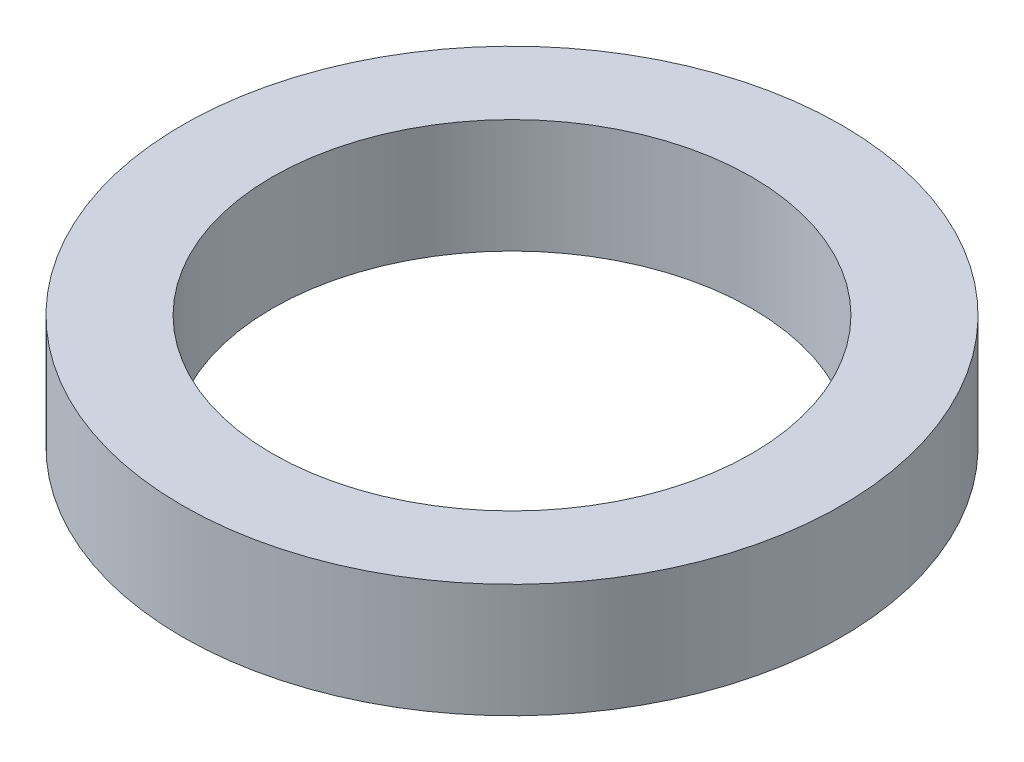
ISO-10303-21;
HEADER;
FILE_DESCRIPTION(('STEP AP214'),'2;1');
FILE_NAME('part.step','',(''),(''),'','','');
FILE_SCHEMA(('AUTOMOTIVE_DESIGN { 1 0 10303 214 1 1 1 1 }'));
ENDSEC;
DATA;
#1=APPLICATION_CONTEXT('core data for automotive mechanical design processes');
#2=APPLICATION_PROTOCOL_DEFINITION('international standard','automotive_design',2000,#1);
#3=PRODUCT_CONTEXT('',#1,'mechanical');
#4=PRODUCT('Part','Part','',(#3));
#5=PRODUCT_RELATED_PRODUCT_CATEGORY('part','',(#4));
#6=PRODUCT_DEFINITION_FORMATION('','',#4);
#7=PRODUCT_DEFINITION_CONTEXT('part definition',#1,'design');
#8=PRODUCT_DEFINITION('design','',#6,#7);
#9=PRODUCT_DEFINITION_SHAPE('','',#8);
#10=(LENGTH_UNIT() NAMED_UNIT(*) SI_UNIT(.MILLI.,.METRE.));
#11=(NAMED_UNIT(*) PLANE_ANGLE_UNIT() SI_UNIT($,.RADIAN.));
#12=(NAMED_UNIT(*) SI_UNIT($,.STERADIAN.) SOLID_ANGLE_UNIT());
#13=UNCERTAINTY_MEASURE_WITH_UNIT(LENGTH_MEASURE(1.E-05),#10,'distance_accuracy_value','');
#14=(GEOMETRIC_REPRESENTATION_CONTEXT(3) GLOBAL_UNCERTAINTY_ASSIGNED_CONTEXT((#13)) GLOBAL_UNIT_ASSIGNED_CONTEXT((#10,
#11,#12)) REPRESENTATION_CONTEXT('',''));
#15=CARTESIAN_POINT('',(0.,0.,0.));
#16=DIRECTION('',(0.,0.,1.));
#17=DIRECTION('',(1.,0.,0.));
#18=AXIS2_PLACEMENT_3D('',#15,#16,#17);
#19=CARTESIAN_POINT('',(0.,19.,0.));
#20=DIRECTION('',(0.,-1.,0.));
#21=DIRECTION('',(0.,0.,-1.));
#22=AXIS2_PLACEMENT_3D('',#19,#20,#21);
#23=CYLINDRICAL_SURFACE('',#22,55.);
#24=CARTESIAN_POINT('',(0.,19.,0.));
#25=DIRECTION('',(0.,1.,0.));
#26=DIRECTION('',(0.,0.,1.));
#27=AXIS2_PLACEMENT_3D('',#24,#25,#26);
#28=CIRCLE('',#27,55.);
#29=CARTESIAN_POINT('',(0.,19.,55.));
#30=VERTEX_POINT('',#29);
#31=EDGE_CURVE('E10',#30,#30,#28,.T.);
#32=ORIENTED_EDGE('',*,*,#31,.F.);
#33=EDGE_LOOP('',(#32));
#34=FACE_BOUND('',#33,.T.);
#35=CARTESIAN_POINT('',(0.,0.,0.));
#36=DIRECTION('',(0.,1.,0.));
#37=DIRECTION('',(0.,0.,1.));
#38=AXIS2_PLACEMENT_3D('',#35,#36,#37);
#39=CIRCLE('',#38,55.);
#40=CARTESIAN_POINT('',(0.,0.,55.));
#41=VERTEX_POINT('',#40);
#42=EDGE_CURVE('E37',#41,#41,#39,.T.);
#43=ORIENTED_EDGE('',*,*,#42,.T.);
#44=EDGE_LOOP('',(#43));
#45=FACE_BOUND('',#44,.T.);
#46=ADVANCED_FACE('F40',(#34,#45),#23,.T.);
#47=CARTESIAN_POINT('',(0.,19.,0.));
#48=DIRECTION('',(0.,1.,0.));
#49=DIRECTION('',(0.,0.,1.));
#50=AXIS2_PLACEMENT_3D('',#47,#48,#49);
#51=PLANE('',#50);
#52=CARTESIAN_POINT('',(0.,19.,0.));
#53=DIRECTION('',(0.,1.,0.));
#54=DIRECTION('',(0.,0.,1.));
#55=AXIS2_PLACEMENT_3D('',#52,#53,#54);
#56=CIRCLE('',#55,40.);
#57=CARTESIAN_POINT('',(0.,19.,40.));
#58=VERTEX_POINT('',#57);
#59=EDGE_CURVE('E50',#58,#58,#56,.T.);
#60=ORIENTED_EDGE('',*,*,#59,.F.);
#61=EDGE_LOOP('',(#60));
#62=FACE_BOUND('',#61,.T.);
#63=ORIENTED_EDGE('',*,*,#31,.T.);
#64=EDGE_LOOP('',(#63));
#65=FACE_BOUND('',#64,.T.);
#66=ADVANCED_FACE('F59',(#62,#65),#51,.T.);
#67=CARTESIAN_POINT('',(0.,0.,0.));
#68=DIRECTION('',(0.,1.,0.));
#69=DIRECTION('',(0.,0.,1.));
#70=AXIS2_PLACEMENT_3D('',#67,#68,#69);
#71=PLANE('',#70);
#72=CARTESIAN_POINT('',(0.,0.,0.));
#73=DIRECTION('',(0.,1.,0.));
#74=DIRECTION('',(0.,0.,1.));
#75=AXIS2_PLACEMENT_3D('',#72,#73,#74);
#76=CIRCLE('',#75,40.);
#77=CARTESIAN_POINT('',(0.,0.,40.));
#78=VERTEX_POINT('',#77);
#79=EDGE_CURVE('E47',#78,#78,#76,.T.);
#80=ORIENTED_EDGE('',*,*,#79,.T.);
#81=EDGE_LOOP('',(#80));
#82=FACE_BOUND('',#81,.T.);
#83=ORIENTED_EDGE('',*,*,#42,.F.);
#84=EDGE_LOOP('',(#83));
#85=FACE_BOUND('',#84,.T.);
#86=ADVANCED_FACE('F58',(#82,#85),#71,.F.);
#87=CARTESIAN_POINT('',(0.,19.,0.));
#88=DIRECTION('',(0.,-1.,0.));
#89=DIRECTION('',(0.,0.,-1.));
#90=AXIS2_PLACEMENT_3D('',#87,#88,#89);
#91=CYLINDRICAL_SURFACE('',#90,40.);
#92=ORIENTED_EDGE('',*,*,#59,.T.);
#93=EDGE_LOOP('',(#92));
#94=FACE_BOUND('',#93,.T.);
#95=ORIENTED_EDGE('',*,*,#79,.F.);
#96=EDGE_LOOP('',(#95));
#97=FACE_BOUND('',#96,.T.);
#98=ADVANCED_FACE('F54',(#94,#97),#91,.F.);
#99=CLOSED_SHELL('',(#46,#66,#86,#98));
#100=MANIFOLD_SOLID_BREP('B2',#99);
#101=ADVANCED_BREP_SHAPE_REPRESENTATION('',(#18,#100),#14);
#102=SHAPE_DEFINITION_REPRESENTATION(#9,#101);
ENDSEC;
END-ISO-10303-21;
